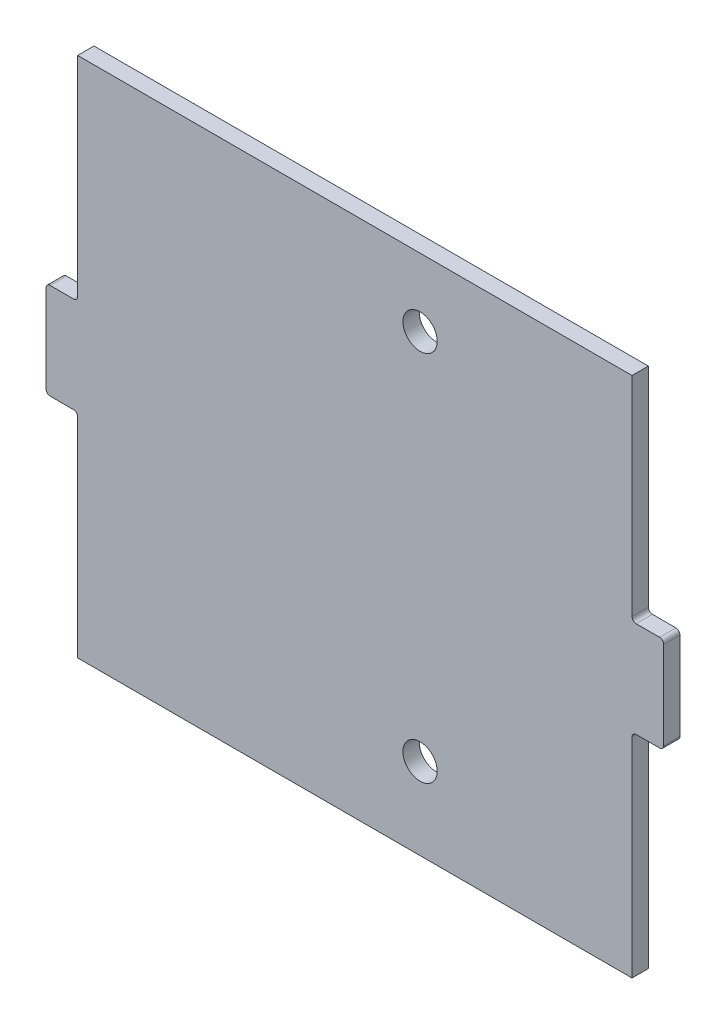
ISO-10303-21;
HEADER;
FILE_DESCRIPTION(('STEP AP214'),'2;1');
FILE_NAME('part.step','',(''),(''),'','','');
FILE_SCHEMA(('AUTOMOTIVE_DESIGN { 1 0 10303 214 1 1 1 1 }'));
ENDSEC;
DATA;
#1=APPLICATION_CONTEXT('core data for automotive mechanical design processes');
#2=APPLICATION_PROTOCOL_DEFINITION('international standard','automotive_design',2000,#1);
#3=PRODUCT_CONTEXT('',#1,'mechanical');
#4=PRODUCT('Part','Part','',(#3));
#5=PRODUCT_RELATED_PRODUCT_CATEGORY('part','',(#4));
#6=PRODUCT_DEFINITION_FORMATION('','',#4);
#7=PRODUCT_DEFINITION_CONTEXT('part definition',#1,'design');
#8=PRODUCT_DEFINITION('design','',#6,#7);
#9=PRODUCT_DEFINITION_SHAPE('','',#8);
#10=(LENGTH_UNIT() NAMED_UNIT(*) SI_UNIT(.MILLI.,.METRE.));
#11=(NAMED_UNIT(*) PLANE_ANGLE_UNIT() SI_UNIT($,.RADIAN.));
#12=(NAMED_UNIT(*) SI_UNIT($,.STERADIAN.) SOLID_ANGLE_UNIT());
#13=UNCERTAINTY_MEASURE_WITH_UNIT(LENGTH_MEASURE(1.E-05),#10,'distance_accuracy_value','');
#14=(GEOMETRIC_REPRESENTATION_CONTEXT(3) GLOBAL_UNCERTAINTY_ASSIGNED_CONTEXT((#13)) GLOBAL_UNIT_ASSIGNED_CONTEXT((#10,
#11,#12)) REPRESENTATION_CONTEXT('',''));
#15=CARTESIAN_POINT('',(0.,0.,0.));
#16=DIRECTION('',(0.,0.,1.));
#17=DIRECTION('',(1.,0.,0.));
#18=AXIS2_PLACEMENT_3D('',#15,#16,#17);
#19=CARTESIAN_POINT('',(215.9,-38.1,6.35));
#20=DIRECTION('',(-1.,0.,0.));
#21=DIRECTION('',(0.,-1.,0.));
#22=AXIS2_PLACEMENT_3D('',#19,#20,#21);
#23=PLANE('',#22);
#24=DIRECTION('',(0.,1.,0.));
#25=VECTOR('',#24,1.);
#26=CARTESIAN_POINT('',(215.9,-38.1,-6.35));
#27=LINE('',#26,#25);
#28=CARTESIAN_POINT('',(215.9,-203.2,-6.35));
#29=VERTEX_POINT('',#28);
#30=CARTESIAN_POINT('',(215.9,-40.513,-6.35));
#31=VERTEX_POINT('',#30);
#32=EDGE_CURVE('E204',#29,#31,#27,.T.);
#33=ORIENTED_EDGE('',*,*,#32,.T.);
#34=DIRECTION('',(0.,0.,-1.));
#35=VECTOR('',#34,1.);
#36=CARTESIAN_POINT('',(215.9,-40.513,6.35));
#37=LINE('',#36,#35);
#38=CARTESIAN_POINT('',(215.9,-40.513,6.35));
#39=VERTEX_POINT('',#38);
#40=EDGE_CURVE('E361',#31,#39,#37,.F.);
#41=ORIENTED_EDGE('',*,*,#40,.T.);
#42=DIRECTION('',(0.,1.,0.));
#43=VECTOR('',#42,1.);
#44=CARTESIAN_POINT('',(215.9,-38.1,6.35));
#45=LINE('',#44,#43);
#46=CARTESIAN_POINT('',(215.9,-203.2,6.35));
#47=VERTEX_POINT('',#46);
#48=EDGE_CURVE('E207',#47,#39,#45,.T.);
#49=ORIENTED_EDGE('',*,*,#48,.F.);
#50=DIRECTION('',(0.,0.,-1.));
#51=VECTOR('',#50,1.);
#52=CARTESIAN_POINT('',(215.9,-203.2,6.35));
#53=LINE('',#52,#51);
#54=EDGE_CURVE('E192',#47,#29,#53,.T.);
#55=ORIENTED_EDGE('',*,*,#54,.T.);
#56=EDGE_LOOP('',(#33,#41,#49,#55));
#57=FACE_BOUND('',#56,.T.);
#58=ADVANCED_FACE('F46',(#57),#23,.F.);
#59=CARTESIAN_POINT('',(215.9,-37.338,6.35));
#60=DIRECTION('',(0.,1.,0.));
#61=DIRECTION('',(-1.,0.,0.));
#62=AXIS2_PLACEMENT_3D('',#59,#60,#61);
#63=PLANE('',#62);
#64=DIRECTION('',(1.,0.,0.));
#65=VECTOR('',#64,1.);
#66=CARTESIAN_POINT('',(215.9,-37.338,-6.35));
#67=LINE('',#66,#65);
#68=CARTESIAN_POINT('',(219.075,-37.338,-6.35));
#69=VERTEX_POINT('',#68);
#70=CARTESIAN_POINT('',(237.363,-37.338,-6.35));
#71=VERTEX_POINT('',#70);
#72=EDGE_CURVE('E209',#69,#71,#67,.T.);
#73=ORIENTED_EDGE('',*,*,#72,.T.);
#74=DIRECTION('',(0.,0.,-1.));
#75=VECTOR('',#74,1.);
#76=CARTESIAN_POINT('',(237.363,-37.338,6.35));
#77=LINE('',#76,#75);
#78=CARTESIAN_POINT('',(237.363,-37.338,6.35));
#79=VERTEX_POINT('',#78);
#80=EDGE_CURVE('E358',#71,#79,#77,.F.);
#81=ORIENTED_EDGE('',*,*,#80,.T.);
#82=DIRECTION('',(1.,0.,0.));
#83=VECTOR('',#82,1.);
#84=CARTESIAN_POINT('',(215.9,-37.338,6.35));
#85=LINE('',#84,#83);
#86=CARTESIAN_POINT('',(219.075,-37.338,6.35));
#87=VERTEX_POINT('',#86);
#88=EDGE_CURVE('E241',#87,#79,#85,.T.);
#89=ORIENTED_EDGE('',*,*,#88,.F.);
#90=DIRECTION('',(0.,0.,-1.));
#91=VECTOR('',#90,1.);
#92=CARTESIAN_POINT('',(219.075,-37.338,-6.35));
#93=LINE('',#92,#91);
#94=EDGE_CURVE('E354',#87,#69,#93,.T.);
#95=ORIENTED_EDGE('',*,*,#94,.T.);
#96=EDGE_LOOP('',(#73,#81,#89,#95));
#97=FACE_BOUND('',#96,.T.);
#98=ADVANCED_FACE('F462',(#97),#63,.F.);
#99=CARTESIAN_POINT('',(240.538,38.1,6.35));
#100=DIRECTION('',(-1.,0.,0.));
#101=DIRECTION('',(0.,0.,1.));
#102=AXIS2_PLACEMENT_3D('',#99,#100,#101);
#103=PLANE('',#102);
#104=DIRECTION('',(0.,1.,0.));
#105=VECTOR('',#104,1.);
#106=CARTESIAN_POINT('',(240.538,38.1,-6.35));
#107=LINE('',#106,#105);
#108=CARTESIAN_POINT('',(240.538,-34.163,-6.35));
#109=VERTEX_POINT('',#108);
#110=CARTESIAN_POINT('',(240.538,34.163,-6.35));
#111=VERTEX_POINT('',#110);
#112=EDGE_CURVE('E243',#109,#111,#107,.T.);
#113=ORIENTED_EDGE('',*,*,#112,.T.);
#114=DIRECTION('',(0.,0.,-1.));
#115=VECTOR('',#114,1.);
#116=CARTESIAN_POINT('',(240.538,34.163,6.35));
#117=LINE('',#116,#115);
#118=CARTESIAN_POINT('',(240.538,34.163,6.35));
#119=VERTEX_POINT('',#118);
#120=EDGE_CURVE('E351',#111,#119,#117,.F.);
#121=ORIENTED_EDGE('',*,*,#120,.T.);
#122=DIRECTION('',(0.,1.,0.));
#123=VECTOR('',#122,1.);
#124=CARTESIAN_POINT('',(240.538,38.1,6.35));
#125=LINE('',#124,#123);
#126=CARTESIAN_POINT('',(240.538,-34.163,6.35));
#127=VERTEX_POINT('',#126);
#128=EDGE_CURVE('E254',#127,#119,#125,.T.);
#129=ORIENTED_EDGE('',*,*,#128,.F.);
#130=DIRECTION('',(0.,0.,-1.));
#131=VECTOR('',#130,1.);
#132=CARTESIAN_POINT('',(240.538,-34.163,6.35));
#133=LINE('',#132,#131);
#134=EDGE_CURVE('E347',#127,#109,#133,.T.);
#135=ORIENTED_EDGE('',*,*,#134,.T.);
#136=EDGE_LOOP('',(#113,#121,#129,#135));
#137=FACE_BOUND('',#136,.T.);
#138=ADVANCED_FACE('F471',(#137),#103,.F.);
#139=CARTESIAN_POINT('',(215.9,37.338,6.35));
#140=DIRECTION('',(0.,-1.,0.));
#141=DIRECTION('',(0.,0.,-1.));
#142=AXIS2_PLACEMENT_3D('',#139,#140,#141);
#143=PLANE('',#142);
#144=DIRECTION('',(-1.,0.,0.));
#145=VECTOR('',#144,1.);
#146=CARTESIAN_POINT('',(215.9,37.338,-6.35));
#147=LINE('',#146,#145);
#148=CARTESIAN_POINT('',(237.363,37.338,-6.35));
#149=VERTEX_POINT('',#148);
#150=CARTESIAN_POINT('',(219.075,37.338,-6.35));
#151=VERTEX_POINT('',#150);
#152=EDGE_CURVE('E247',#149,#151,#147,.T.);
#153=ORIENTED_EDGE('',*,*,#152,.T.);
#154=DIRECTION('',(0.,0.,-1.));
#155=VECTOR('',#154,1.);
#156=CARTESIAN_POINT('',(219.075,37.338,6.35));
#157=LINE('',#156,#155);
#158=CARTESIAN_POINT('',(219.075,37.338,6.35));
#159=VERTEX_POINT('',#158);
#160=EDGE_CURVE('E344',#151,#159,#157,.F.);
#161=ORIENTED_EDGE('',*,*,#160,.T.);
#162=DIRECTION('',(-1.,0.,0.));
#163=VECTOR('',#162,1.);
#164=CARTESIAN_POINT('',(215.9,37.338,6.35));
#165=LINE('',#164,#163);
#166=CARTESIAN_POINT('',(237.363,37.338,6.35));
#167=VERTEX_POINT('',#166);
#168=EDGE_CURVE('E238',#167,#159,#165,.T.);
#169=ORIENTED_EDGE('',*,*,#168,.F.);
#170=DIRECTION('',(0.,0.,-1.));
#171=VECTOR('',#170,1.);
#172=CARTESIAN_POINT('',(237.363,37.338,6.35));
#173=LINE('',#172,#171);
#174=EDGE_CURVE('E340',#167,#149,#173,.T.);
#175=ORIENTED_EDGE('',*,*,#174,.T.);
#176=EDGE_LOOP('',(#153,#161,#169,#175));
#177=FACE_BOUND('',#176,.T.);
#178=ADVANCED_FACE('F480',(#177),#143,.F.);
#179=CARTESIAN_POINT('',(215.9,203.2,6.35));
#180=DIRECTION('',(-1.,0.,0.));
#181=DIRECTION('',(0.,-1.,0.));
#182=AXIS2_PLACEMENT_3D('',#179,#180,#181);
#183=PLANE('',#182);
#184=DIRECTION('',(0.,1.,0.));
#185=VECTOR('',#184,1.);
#186=CARTESIAN_POINT('',(215.9,203.2,6.35));
#187=LINE('',#186,#185);
#188=CARTESIAN_POINT('',(215.9,40.513,6.35));
#189=VERTEX_POINT('',#188);
#190=CARTESIAN_POINT('',(215.9,203.2,6.35));
#191=VERTEX_POINT('',#190);
#192=EDGE_CURVE('E235',#189,#191,#187,.T.);
#193=ORIENTED_EDGE('',*,*,#192,.F.);
#194=DIRECTION('',(0.,0.,-1.));
#195=VECTOR('',#194,1.);
#196=CARTESIAN_POINT('',(215.9,40.513,-6.35));
#197=LINE('',#196,#195);
#198=CARTESIAN_POINT('',(215.9,40.513,-6.35));
#199=VERTEX_POINT('',#198);
#200=EDGE_CURVE('E336',#189,#199,#197,.T.);
#201=ORIENTED_EDGE('',*,*,#200,.T.);
#202=DIRECTION('',(0.,1.,0.));
#203=VECTOR('',#202,1.);
#204=CARTESIAN_POINT('',(215.9,203.2,-6.35));
#205=LINE('',#204,#203);
#206=CARTESIAN_POINT('',(215.9,203.2,-6.35));
#207=VERTEX_POINT('',#206);
#208=EDGE_CURVE('E218',#199,#207,#205,.T.);
#209=ORIENTED_EDGE('',*,*,#208,.T.);
#210=DIRECTION('',(0.,0.,-1.));
#211=VECTOR('',#210,1.);
#212=CARTESIAN_POINT('',(215.9,203.2,6.35));
#213=LINE('',#212,#211);
#214=EDGE_CURVE('E403',#191,#207,#213,.T.);
#215=ORIENTED_EDGE('',*,*,#214,.F.);
#216=EDGE_LOOP('',(#193,#201,#209,#215));
#217=FACE_BOUND('',#216,.T.);
#218=ADVANCED_FACE('F417',(#217),#183,.F.);
#219=CARTESIAN_POINT('',(-215.9,203.2,6.35));
#220=DIRECTION('',(0.,-1.,0.));
#221=DIRECTION('',(0.,0.,-1.));
#222=AXIS2_PLACEMENT_3D('',#219,#220,#221);
#223=PLANE('',#222);
#224=DIRECTION('',(-1.,0.,0.));
#225=VECTOR('',#224,1.);
#226=CARTESIAN_POINT('',(-215.9,203.2,-6.35));
#227=LINE('',#226,#225);
#228=CARTESIAN_POINT('',(-215.9,203.2,-6.35));
#229=VERTEX_POINT('',#228);
#230=EDGE_CURVE('E404',#207,#229,#227,.T.);
#231=ORIENTED_EDGE('',*,*,#230,.T.);
#232=DIRECTION('',(0.,0.,-1.));
#233=VECTOR('',#232,1.);
#234=CARTESIAN_POINT('',(-215.9,203.2,6.35));
#235=LINE('',#234,#233);
#236=CARTESIAN_POINT('',(-215.9,203.2,6.35));
#237=VERTEX_POINT('',#236);
#238=EDGE_CURVE('E268',#237,#229,#235,.T.);
#239=ORIENTED_EDGE('',*,*,#238,.F.);
#240=DIRECTION('',(-1.,0.,0.));
#241=VECTOR('',#240,1.);
#242=CARTESIAN_POINT('',(-215.9,203.2,6.35));
#243=LINE('',#242,#241);
#244=EDGE_CURVE('E232',#191,#237,#243,.T.);
#245=ORIENTED_EDGE('',*,*,#244,.F.);
#246=ORIENTED_EDGE('',*,*,#214,.T.);
#247=EDGE_LOOP('',(#231,#239,#245,#246));
#248=FACE_BOUND('',#247,.T.);
#249=ADVANCED_FACE('F420',(#248),#223,.F.);
#250=CARTESIAN_POINT('',(-215.9,203.2,6.35));
#251=DIRECTION('',(1.,0.,0.));
#252=DIRECTION('',(0.,0.,-1.));
#253=AXIS2_PLACEMENT_3D('',#250,#251,#252);
#254=PLANE('',#253);
#255=DIRECTION('',(0.,-1.,0.));
#256=VECTOR('',#255,1.);
#257=CARTESIAN_POINT('',(-215.9,203.2,-6.35));
#258=LINE('',#257,#256);
#259=CARTESIAN_POINT('',(-215.9,40.513,-6.35));
#260=VERTEX_POINT('',#259);
#261=EDGE_CURVE('E400',#229,#260,#258,.T.);
#262=ORIENTED_EDGE('',*,*,#261,.T.);
#263=DIRECTION('',(0.,0.,-1.));
#264=VECTOR('',#263,1.);
#265=CARTESIAN_POINT('',(-215.9,40.513,6.35));
#266=LINE('',#265,#264);
#267=CARTESIAN_POINT('',(-215.9,40.513,6.35));
#268=VERTEX_POINT('',#267);
#269=EDGE_CURVE('E333',#260,#268,#266,.F.);
#270=ORIENTED_EDGE('',*,*,#269,.T.);
#271=DIRECTION('',(0.,-1.,0.));
#272=VECTOR('',#271,1.);
#273=CARTESIAN_POINT('',(-215.9,203.2,6.35));
#274=LINE('',#273,#272);
#275=EDGE_CURVE('E228',#237,#268,#274,.T.);
#276=ORIENTED_EDGE('',*,*,#275,.F.);
#277=ORIENTED_EDGE('',*,*,#238,.T.);
#278=EDGE_LOOP('',(#262,#270,#276,#277));
#279=FACE_BOUND('',#278,.T.);
#280=ADVANCED_FACE('F425',(#279),#254,.F.);
#281=CARTESIAN_POINT('',(-215.9,37.338,6.35));
#282=DIRECTION('',(0.,-1.,0.));
#283=DIRECTION('',(1.,0.,0.));
#284=AXIS2_PLACEMENT_3D('',#281,#282,#283);
#285=PLANE('',#284);
#286=DIRECTION('',(-1.,0.,0.));
#287=VECTOR('',#286,1.);
#288=CARTESIAN_POINT('',(-215.9,37.338,-6.35));
#289=LINE('',#288,#287);
#290=CARTESIAN_POINT('',(-219.075,37.338,-6.35));
#291=VERTEX_POINT('',#290);
#292=CARTESIAN_POINT('',(-237.363,37.338,-6.35));
#293=VERTEX_POINT('',#292);
#294=EDGE_CURVE('E264',#291,#293,#289,.T.);
#295=ORIENTED_EDGE('',*,*,#294,.T.);
#296=DIRECTION('',(0.,0.,-1.));
#297=VECTOR('',#296,1.);
#298=CARTESIAN_POINT('',(-237.363,37.338,6.35));
#299=LINE('',#298,#297);
#300=CARTESIAN_POINT('',(-237.363,37.338,6.35));
#301=VERTEX_POINT('',#300);
#302=EDGE_CURVE('E64',#293,#301,#299,.F.);
#303=ORIENTED_EDGE('',*,*,#302,.T.);
#304=DIRECTION('',(-1.,0.,0.));
#305=VECTOR('',#304,1.);
#306=CARTESIAN_POINT('',(-215.9,37.338,6.35));
#307=LINE('',#306,#305);
#308=CARTESIAN_POINT('',(-219.075,37.338,6.35));
#309=VERTEX_POINT('',#308);
#310=EDGE_CURVE('E231',#309,#301,#307,.T.);
#311=ORIENTED_EDGE('',*,*,#310,.F.);
#312=DIRECTION('',(0.,0.,-1.));
#313=VECTOR('',#312,1.);
#314=CARTESIAN_POINT('',(-219.075,37.338,-6.35));
#315=LINE('',#314,#313);
#316=EDGE_CURVE('E327',#309,#291,#315,.T.);
#317=ORIENTED_EDGE('',*,*,#316,.T.);
#318=EDGE_LOOP('',(#295,#303,#311,#317));
#319=FACE_BOUND('',#318,.T.);
#320=ADVANCED_FACE('F430',(#319),#285,.F.);
#321=CARTESIAN_POINT('',(-240.538,38.1,6.35));
#322=DIRECTION('',(1.,0.,0.));
#323=DIRECTION('',(0.,0.,-1.));
#324=AXIS2_PLACEMENT_3D('',#321,#322,#323);
#325=PLANE('',#324);
#326=DIRECTION('',(0.,-1.,0.));
#327=VECTOR('',#326,1.);
#328=CARTESIAN_POINT('',(-240.538,38.1,-6.35));
#329=LINE('',#328,#327);
#330=CARTESIAN_POINT('',(-240.538,34.163,-6.35));
#331=VERTEX_POINT('',#330);
#332=CARTESIAN_POINT('',(-240.538,-34.163,-6.35));
#333=VERTEX_POINT('',#332);
#334=EDGE_CURVE('E267',#331,#333,#329,.T.);
#335=ORIENTED_EDGE('',*,*,#334,.T.);
#336=DIRECTION('',(0.,0.,-1.));
#337=VECTOR('',#336,1.);
#338=CARTESIAN_POINT('',(-240.538,-34.163,6.35));
#339=LINE('',#338,#337);
#340=CARTESIAN_POINT('',(-240.538,-34.163,6.35));
#341=VERTEX_POINT('',#340);
#342=EDGE_CURVE('E312',#333,#341,#339,.F.);
#343=ORIENTED_EDGE('',*,*,#342,.T.);
#344=DIRECTION('',(0.,-1.,0.));
#345=VECTOR('',#344,1.);
#346=CARTESIAN_POINT('',(-240.538,38.1,6.35));
#347=LINE('',#346,#345);
#348=CARTESIAN_POINT('',(-240.538,34.163,6.35));
#349=VERTEX_POINT('',#348);
#350=EDGE_CURVE('E271',#349,#341,#347,.T.);
#351=ORIENTED_EDGE('',*,*,#350,.F.);
#352=DIRECTION('',(0.,0.,-1.));
#353=VECTOR('',#352,1.);
#354=CARTESIAN_POINT('',(-240.538,34.163,6.35));
#355=LINE('',#354,#353);
#356=EDGE_CURVE('E308',#349,#331,#355,.T.);
#357=ORIENTED_EDGE('',*,*,#356,.T.);
#358=EDGE_LOOP('',(#335,#343,#351,#357));
#359=FACE_BOUND('',#358,.T.);
#360=ADVANCED_FACE('F438',(#359),#325,.F.);
#361=CARTESIAN_POINT('',(-215.9,-37.338,6.35));
#362=DIRECTION('',(0.,1.,0.));
#363=DIRECTION('',(-1.,0.,0.));
#364=AXIS2_PLACEMENT_3D('',#361,#362,#363);
#365=PLANE('',#364);
#366=DIRECTION('',(1.,0.,0.));
#367=VECTOR('',#366,1.);
#368=CARTESIAN_POINT('',(-215.9,-37.338,-6.35));
#369=LINE('',#368,#367);
#370=CARTESIAN_POINT('',(-237.363,-37.338,-6.35));
#371=VERTEX_POINT('',#370);
#372=CARTESIAN_POINT('',(-219.075,-37.338,-6.35));
#373=VERTEX_POINT('',#372);
#374=EDGE_CURVE('E278',#371,#373,#369,.T.);
#375=ORIENTED_EDGE('',*,*,#374,.T.);
#376=DIRECTION('',(0.,0.,-1.));
#377=VECTOR('',#376,1.);
#378=CARTESIAN_POINT('',(-219.075,-37.338,6.35));
#379=LINE('',#378,#377);
#380=CARTESIAN_POINT('',(-219.075,-37.338,6.35));
#381=VERTEX_POINT('',#380);
#382=EDGE_CURVE('E293',#373,#381,#379,.F.);
#383=ORIENTED_EDGE('',*,*,#382,.T.);
#384=DIRECTION('',(1.,0.,0.));
#385=VECTOR('',#384,1.);
#386=CARTESIAN_POINT('',(-215.9,-37.338,6.35));
#387=LINE('',#386,#385);
#388=CARTESIAN_POINT('',(-237.363,-37.338,6.35));
#389=VERTEX_POINT('',#388);
#390=EDGE_CURVE('E227',#389,#381,#387,.T.);
#391=ORIENTED_EDGE('',*,*,#390,.F.);
#392=DIRECTION('',(0.,0.,-1.));
#393=VECTOR('',#392,1.);
#394=CARTESIAN_POINT('',(-237.363,-37.338,6.35));
#395=LINE('',#394,#393);
#396=EDGE_CURVE('E289',#389,#371,#395,.T.);
#397=ORIENTED_EDGE('',*,*,#396,.T.);
#398=EDGE_LOOP('',(#375,#383,#391,#397));
#399=FACE_BOUND('',#398,.T.);
#400=ADVANCED_FACE('F447',(#399),#365,.F.);
#401=CARTESIAN_POINT('',(-215.9,-38.1,6.35));
#402=DIRECTION('',(1.,0.,0.));
#403=DIRECTION('',(0.,1.,0.));
#404=AXIS2_PLACEMENT_3D('',#401,#402,#403);
#405=PLANE('',#404);
#406=DIRECTION('',(0.,-1.,0.));
#407=VECTOR('',#406,1.);
#408=CARTESIAN_POINT('',(-215.9,-38.1,6.35));
#409=LINE('',#408,#407);
#410=CARTESIAN_POINT('',(-215.9,-40.513,6.35));
#411=VERTEX_POINT('',#410);
#412=CARTESIAN_POINT('',(-215.9,-203.2,6.35));
#413=VERTEX_POINT('',#412);
#414=EDGE_CURVE('E224',#411,#413,#409,.T.);
#415=ORIENTED_EDGE('',*,*,#414,.F.);
#416=DIRECTION('',(0.,0.,-1.));
#417=VECTOR('',#416,1.);
#418=CARTESIAN_POINT('',(-215.9,-40.513,-6.35));
#419=LINE('',#418,#417);
#420=CARTESIAN_POINT('',(-215.9,-40.513,-6.35));
#421=VERTEX_POINT('',#420);
#422=EDGE_CURVE('E285',#411,#421,#419,.T.);
#423=ORIENTED_EDGE('',*,*,#422,.T.);
#424=DIRECTION('',(0.,-1.,0.));
#425=VECTOR('',#424,1.);
#426=CARTESIAN_POINT('',(-215.9,-38.1,-6.35));
#427=LINE('',#426,#425);
#428=CARTESIAN_POINT('',(-215.9,-203.2,-6.35));
#429=VERTEX_POINT('',#428);
#430=EDGE_CURVE('E200',#421,#429,#427,.T.);
#431=ORIENTED_EDGE('',*,*,#430,.T.);
#432=DIRECTION('',(0.,0.,-1.));
#433=VECTOR('',#432,1.);
#434=CARTESIAN_POINT('',(-215.9,-203.2,6.35));
#435=LINE('',#434,#433);
#436=EDGE_CURVE('E195',#413,#429,#435,.T.);
#437=ORIENTED_EDGE('',*,*,#436,.F.);
#438=EDGE_LOOP('',(#415,#423,#431,#437));
#439=FACE_BOUND('',#438,.T.);
#440=ADVANCED_FACE('F455',(#439),#405,.F.);
#441=CARTESIAN_POINT('',(-215.9,-203.2,6.35));
#442=DIRECTION('',(0.,1.,0.));
#443=DIRECTION('',(0.,0.,1.));
#444=AXIS2_PLACEMENT_3D('',#441,#442,#443);
#445=PLANE('',#444);
#446=DIRECTION('',(1.,0.,0.));
#447=VECTOR('',#446,1.);
#448=CARTESIAN_POINT('',(-215.9,-203.2,-6.35));
#449=LINE('',#448,#447);
#450=EDGE_CURVE('E188',#429,#29,#449,.T.);
#451=ORIENTED_EDGE('',*,*,#450,.T.);
#452=ORIENTED_EDGE('',*,*,#54,.F.);
#453=DIRECTION('',(1.,0.,0.));
#454=VECTOR('',#453,1.);
#455=CARTESIAN_POINT('',(-215.9,-203.2,6.35));
#456=LINE('',#455,#454);
#457=EDGE_CURVE('E220',#413,#47,#456,.T.);
#458=ORIENTED_EDGE('',*,*,#457,.F.);
#459=ORIENTED_EDGE('',*,*,#436,.T.);
#460=EDGE_LOOP('',(#451,#452,#458,#459));
#461=FACE_BOUND('',#460,.T.);
#462=ADVANCED_FACE('F190',(#461),#445,.F.);
#463=CARTESIAN_POINT('',(0.,0.,6.35));
#464=DIRECTION('',(0.,0.,1.));
#465=DIRECTION('',(1.,0.,0.));
#466=AXIS2_PLACEMENT_3D('',#463,#464,#465);
#467=PLANE('',#466);
#468=CARTESIAN_POINT('',(50.8000000000004,150.299999999983,6.34999999999999));
#469=DIRECTION('',(0.,0.,1.));
#470=DIRECTION('',(1.,0.,0.));
#471=AXIS2_PLACEMENT_3D('',#468,#469,#470);
#472=CIRCLE('',#471,13.3350000000001);
#473=CARTESIAN_POINT('',(64.1350000000005,150.299999999983,6.34999999999999));
#474=VERTEX_POINT('',#473);
#475=EDGE_CURVE('E386',#474,#474,#472,.F.);
#476=ORIENTED_EDGE('',*,*,#475,.T.);
#477=EDGE_LOOP('',(#476));
#478=FACE_BOUND('',#477,.T.);
#479=CARTESIAN_POINT('',(50.8000000000004,-139.700000000005,6.34999999999999));
#480=DIRECTION('',(0.,0.,1.));
#481=DIRECTION('',(1.,0.,0.));
#482=AXIS2_PLACEMENT_3D('',#479,#480,#481);
#483=CIRCLE('',#482,13.3350000000001);
#484=CARTESIAN_POINT('',(64.1350000000005,-139.700000000005,6.34999999999999));
#485=VERTEX_POINT('',#484);
#486=EDGE_CURVE('E242',#485,#485,#483,.F.);
#487=ORIENTED_EDGE('',*,*,#486,.T.);
#488=EDGE_LOOP('',(#487));
#489=FACE_BOUND('',#488,.T.);
#490=ORIENTED_EDGE('',*,*,#350,.T.);
#491=CARTESIAN_POINT('',(-237.363,-34.163,6.35));
#492=DIRECTION('',(0.,0.,1.));
#493=DIRECTION('',(1.,0.,0.));
#494=AXIS2_PLACEMENT_3D('',#491,#492,#493);
#495=CIRCLE('',#494,3.175);
#496=EDGE_CURVE('E324',#341,#389,#495,.T.);
#497=ORIENTED_EDGE('',*,*,#496,.T.);
#498=ORIENTED_EDGE('',*,*,#390,.T.);
#499=CARTESIAN_POINT('',(-219.075,-40.513,6.35));
#500=DIRECTION('',(0.,0.,1.));
#501=DIRECTION('',(1.,0.,0.));
#502=AXIS2_PLACEMENT_3D('',#499,#500,#501);
#503=CIRCLE('',#502,3.175);
#504=EDGE_CURVE('E367',#381,#411,#503,.F.);
#505=ORIENTED_EDGE('',*,*,#504,.T.);
#506=ORIENTED_EDGE('',*,*,#414,.T.);
#507=ORIENTED_EDGE('',*,*,#457,.T.);
#508=ORIENTED_EDGE('',*,*,#48,.T.);
#509=CARTESIAN_POINT('',(219.075,-40.513,6.35));
#510=DIRECTION('',(0.,0.,1.));
#511=DIRECTION('',(1.,0.,0.));
#512=AXIS2_PLACEMENT_3D('',#509,#510,#511);
#513=CIRCLE('',#512,3.175);
#514=EDGE_CURVE('E12',#39,#87,#513,.F.);
#515=ORIENTED_EDGE('',*,*,#514,.T.);
#516=ORIENTED_EDGE('',*,*,#88,.T.);
#517=CARTESIAN_POINT('',(237.363,-34.163,6.35));
#518=DIRECTION('',(0.,0.,1.));
#519=DIRECTION('',(1.,0.,0.));
#520=AXIS2_PLACEMENT_3D('',#517,#518,#519);
#521=CIRCLE('',#520,3.175);
#522=EDGE_CURVE('E315',#79,#127,#521,.T.);
#523=ORIENTED_EDGE('',*,*,#522,.T.);
#524=ORIENTED_EDGE('',*,*,#128,.T.);
#525=CARTESIAN_POINT('',(237.363,34.163,6.35));
#526=DIRECTION('',(0.,0.,1.));
#527=DIRECTION('',(1.,0.,0.));
#528=AXIS2_PLACEMENT_3D('',#525,#526,#527);
#529=CIRCLE('',#528,3.175);
#530=EDGE_CURVE('E318',#119,#167,#529,.T.);
#531=ORIENTED_EDGE('',*,*,#530,.T.);
#532=ORIENTED_EDGE('',*,*,#168,.T.);
#533=CARTESIAN_POINT('',(219.075,40.513,6.35));
#534=DIRECTION('',(0.,0.,1.));
#535=DIRECTION('',(1.,0.,0.));
#536=AXIS2_PLACEMENT_3D('',#533,#534,#535);
#537=CIRCLE('',#536,3.175);
#538=EDGE_CURVE('E378',#159,#189,#537,.F.);
#539=ORIENTED_EDGE('',*,*,#538,.T.);
#540=ORIENTED_EDGE('',*,*,#192,.T.);
#541=ORIENTED_EDGE('',*,*,#244,.T.);
#542=ORIENTED_EDGE('',*,*,#275,.T.);
#543=CARTESIAN_POINT('',(-219.075,40.513,6.35));
#544=DIRECTION('',(0.,0.,1.));
#545=DIRECTION('',(1.,0.,0.));
#546=AXIS2_PLACEMENT_3D('',#543,#544,#545);
#547=CIRCLE('',#546,3.175);
#548=EDGE_CURVE('E71',#268,#309,#547,.F.);
#549=ORIENTED_EDGE('',*,*,#548,.T.);
#550=ORIENTED_EDGE('',*,*,#310,.T.);
#551=CARTESIAN_POINT('',(-237.363,34.163,6.35));
#552=DIRECTION('',(0.,0.,1.));
#553=DIRECTION('',(1.,0.,0.));
#554=AXIS2_PLACEMENT_3D('',#551,#552,#553);
#555=CIRCLE('',#554,3.175);
#556=EDGE_CURVE('E321',#301,#349,#555,.T.);
#557=ORIENTED_EDGE('',*,*,#556,.T.);
#558=EDGE_LOOP('',(#490,#497,#498,#505,#506,#507,#508,#515,#516,#523,#524,#531,#532,#539,#540,
#541,#542,#549,#550,#557));
#559=FACE_BOUND('',#558,.T.);
#560=ADVANCED_FACE('F441',(#478,#489,#559),#467,.T.);
#561=CARTESIAN_POINT('',(0.,0.,-6.35));
#562=DIRECTION('',(0.,0.,1.));
#563=DIRECTION('',(1.,0.,0.));
#564=AXIS2_PLACEMENT_3D('',#561,#562,#563);
#565=PLANE('',#564);
#566=CARTESIAN_POINT('',(50.8000000000004,150.299999999983,-6.35000000000002));
#567=DIRECTION('',(0.,0.,1.));
#568=DIRECTION('',(1.,0.,0.));
#569=AXIS2_PLACEMENT_3D('',#566,#567,#568);
#570=CIRCLE('',#569,13.3350000000001);
#571=CARTESIAN_POINT('',(64.1350000000005,150.299999999983,-6.35000000000002));
#572=VERTEX_POINT('',#571);
#573=EDGE_CURVE('E50',#572,#572,#570,.F.);
#574=ORIENTED_EDGE('',*,*,#573,.F.);
#575=EDGE_LOOP('',(#574));
#576=FACE_BOUND('',#575,.T.);
#577=CARTESIAN_POINT('',(50.8000000000004,-139.700000000005,-6.34999999999999));
#578=DIRECTION('',(0.,0.,1.));
#579=DIRECTION('',(1.,0.,0.));
#580=AXIS2_PLACEMENT_3D('',#577,#578,#579);
#581=CIRCLE('',#580,13.3350000000001);
#582=CARTESIAN_POINT('',(64.1350000000005,-139.700000000005,-6.34999999999999));
#583=VERTEX_POINT('',#582);
#584=EDGE_CURVE('E223',#583,#583,#581,.F.);
#585=ORIENTED_EDGE('',*,*,#584,.F.);
#586=EDGE_LOOP('',(#585));
#587=FACE_BOUND('',#586,.T.);
#588=ORIENTED_EDGE('',*,*,#374,.F.);
#589=CARTESIAN_POINT('',(-237.363,-34.163,-6.35));
#590=DIRECTION('',(0.,0.,1.));
#591=DIRECTION('',(1.,0.,0.));
#592=AXIS2_PLACEMENT_3D('',#589,#590,#591);
#593=CIRCLE('',#592,3.175);
#594=EDGE_CURVE('E305',#371,#333,#593,.F.);
#595=ORIENTED_EDGE('',*,*,#594,.T.);
#596=ORIENTED_EDGE('',*,*,#334,.F.);
#597=CARTESIAN_POINT('',(-237.363,34.163,-6.35));
#598=DIRECTION('',(0.,0.,1.));
#599=DIRECTION('',(1.,0.,0.));
#600=AXIS2_PLACEMENT_3D('',#597,#598,#599);
#601=CIRCLE('',#600,3.175);
#602=EDGE_CURVE('E302',#331,#293,#601,.F.);
#603=ORIENTED_EDGE('',*,*,#602,.T.);
#604=ORIENTED_EDGE('',*,*,#294,.F.);
#605=CARTESIAN_POINT('',(-219.075,40.513,-6.35));
#606=DIRECTION('',(0.,0.,1.));
#607=DIRECTION('',(1.,0.,0.));
#608=AXIS2_PLACEMENT_3D('',#605,#606,#607);
#609=CIRCLE('',#608,3.175);
#610=EDGE_CURVE('E370',#291,#260,#609,.T.);
#611=ORIENTED_EDGE('',*,*,#610,.T.);
#612=ORIENTED_EDGE('',*,*,#261,.F.);
#613=ORIENTED_EDGE('',*,*,#230,.F.);
#614=ORIENTED_EDGE('',*,*,#208,.F.);
#615=CARTESIAN_POINT('',(219.075,40.513,-6.35));
#616=DIRECTION('',(0.,0.,1.));
#617=DIRECTION('',(1.,0.,0.));
#618=AXIS2_PLACEMENT_3D('',#615,#616,#617);
#619=CIRCLE('',#618,3.175);
#620=EDGE_CURVE('E375',#199,#151,#619,.T.);
#621=ORIENTED_EDGE('',*,*,#620,.T.);
#622=ORIENTED_EDGE('',*,*,#152,.F.);
#623=CARTESIAN_POINT('',(237.363,34.163,-6.35));
#624=DIRECTION('',(0.,0.,1.));
#625=DIRECTION('',(1.,0.,0.));
#626=AXIS2_PLACEMENT_3D('',#623,#624,#625);
#627=CIRCLE('',#626,3.175);
#628=EDGE_CURVE('E299',#149,#111,#627,.F.);
#629=ORIENTED_EDGE('',*,*,#628,.T.);
#630=ORIENTED_EDGE('',*,*,#112,.F.);
#631=CARTESIAN_POINT('',(237.363,-34.163,-6.35));
#632=DIRECTION('',(0.,0.,1.));
#633=DIRECTION('',(1.,0.,0.));
#634=AXIS2_PLACEMENT_3D('',#631,#632,#633);
#635=CIRCLE('',#634,3.175);
#636=EDGE_CURVE('E296',#109,#71,#635,.F.);
#637=ORIENTED_EDGE('',*,*,#636,.T.);
#638=ORIENTED_EDGE('',*,*,#72,.F.);
#639=CARTESIAN_POINT('',(219.075,-40.513,-6.35));
#640=DIRECTION('',(0.,0.,1.));
#641=DIRECTION('',(1.,0.,0.));
#642=AXIS2_PLACEMENT_3D('',#639,#640,#641);
#643=CIRCLE('',#642,3.175);
#644=EDGE_CURVE('E56',#69,#31,#643,.T.);
#645=ORIENTED_EDGE('',*,*,#644,.T.);
#646=ORIENTED_EDGE('',*,*,#32,.F.);
#647=ORIENTED_EDGE('',*,*,#450,.F.);
#648=ORIENTED_EDGE('',*,*,#430,.F.);
#649=CARTESIAN_POINT('',(-219.075,-40.513,-6.35));
#650=DIRECTION('',(0.,0.,1.));
#651=DIRECTION('',(1.,0.,0.));
#652=AXIS2_PLACEMENT_3D('',#649,#650,#651);
#653=CIRCLE('',#652,3.175);
#654=EDGE_CURVE('E364',#421,#373,#653,.T.);
#655=ORIENTED_EDGE('',*,*,#654,.T.);
#656=EDGE_LOOP('',(#588,#595,#596,#603,#604,#611,#612,#613,#614,#621,#622,#629,#630,#637,#638,
#645,#646,#647,#648,#655));
#657=FACE_BOUND('',#656,.T.);
#658=ADVANCED_FACE('F212',(#576,#587,#657),#565,.F.);
#659=CARTESIAN_POINT('',(50.8000000000004,-139.700000000005,173.4));
#660=DIRECTION('',(0.,0.,-1.));
#661=DIRECTION('',(-1.,0.,0.));
#662=AXIS2_PLACEMENT_3D('',#659,#660,#661);
#663=CYLINDRICAL_SURFACE('',#662,13.3350000000001);
#664=ORIENTED_EDGE('',*,*,#486,.F.);
#665=EDGE_LOOP('',(#664));
#666=FACE_BOUND('',#665,.T.);
#667=ORIENTED_EDGE('',*,*,#584,.T.);
#668=EDGE_LOOP('',(#667));
#669=FACE_BOUND('',#668,.T.);
#670=ADVANCED_FACE('F513',(#666,#669),#663,.F.);
#671=CARTESIAN_POINT('',(50.8000000000004,150.299999999983,248.4));
#672=DIRECTION('',(0.,0.,-1.));
#673=DIRECTION('',(-1.,0.,0.));
#674=AXIS2_PLACEMENT_3D('',#671,#672,#673);
#675=CYLINDRICAL_SURFACE('',#674,13.3350000000001);
#676=ORIENTED_EDGE('',*,*,#475,.F.);
#677=EDGE_LOOP('',(#676));
#678=FACE_BOUND('',#677,.T.);
#679=ORIENTED_EDGE('',*,*,#573,.T.);
#680=EDGE_LOOP('',(#679));
#681=FACE_BOUND('',#680,.T.);
#682=ADVANCED_FACE('F48',(#678,#681),#675,.F.);
#683=CARTESIAN_POINT('',(-219.075,-40.513,6.35));
#684=DIRECTION('',(0.,0.,1.));
#685=DIRECTION('',(1.,0.,0.));
#686=AXIS2_PLACEMENT_3D('',#683,#684,#685);
#687=CYLINDRICAL_SURFACE('',#686,3.175);
#688=ORIENTED_EDGE('',*,*,#504,.F.);
#689=ORIENTED_EDGE('',*,*,#382,.F.);
#690=ORIENTED_EDGE('',*,*,#654,.F.);
#691=ORIENTED_EDGE('',*,*,#422,.F.);
#692=EDGE_LOOP('',(#688,#689,#690,#691));
#693=FACE_BOUND('',#692,.T.);
#694=ADVANCED_FACE('F452',(#693),#687,.F.);
#695=CARTESIAN_POINT('',(-237.363,-34.163,6.35));
#696=DIRECTION('',(0.,0.,-1.));
#697=DIRECTION('',(-1.,0.,0.));
#698=AXIS2_PLACEMENT_3D('',#695,#696,#697);
#699=CYLINDRICAL_SURFACE('',#698,3.175);
#700=ORIENTED_EDGE('',*,*,#496,.F.);
#701=ORIENTED_EDGE('',*,*,#342,.F.);
#702=ORIENTED_EDGE('',*,*,#594,.F.);
#703=ORIENTED_EDGE('',*,*,#396,.F.);
#704=EDGE_LOOP('',(#700,#701,#702,#703));
#705=FACE_BOUND('',#704,.T.);
#706=ADVANCED_FACE('F445',(#705),#699,.T.);
#707=CARTESIAN_POINT('',(-237.363,34.163,6.35));
#708=DIRECTION('',(0.,0.,-1.));
#709=DIRECTION('',(-1.,0.,0.));
#710=AXIS2_PLACEMENT_3D('',#707,#708,#709);
#711=CYLINDRICAL_SURFACE('',#710,3.175);
#712=ORIENTED_EDGE('',*,*,#556,.F.);
#713=ORIENTED_EDGE('',*,*,#302,.F.);
#714=ORIENTED_EDGE('',*,*,#602,.F.);
#715=ORIENTED_EDGE('',*,*,#356,.F.);
#716=EDGE_LOOP('',(#712,#713,#714,#715));
#717=FACE_BOUND('',#716,.T.);
#718=ADVANCED_FACE('F435',(#717),#711,.T.);
#719=CARTESIAN_POINT('',(-219.075,40.513,6.35));
#720=DIRECTION('',(0.,0.,1.));
#721=DIRECTION('',(1.,0.,0.));
#722=AXIS2_PLACEMENT_3D('',#719,#720,#721);
#723=CYLINDRICAL_SURFACE('',#722,3.175);
#724=ORIENTED_EDGE('',*,*,#548,.F.);
#725=ORIENTED_EDGE('',*,*,#269,.F.);
#726=ORIENTED_EDGE('',*,*,#610,.F.);
#727=ORIENTED_EDGE('',*,*,#316,.F.);
#728=EDGE_LOOP('',(#724,#725,#726,#727));
#729=FACE_BOUND('',#728,.T.);
#730=ADVANCED_FACE('F428',(#729),#723,.F.);
#731=CARTESIAN_POINT('',(219.075,40.513,6.35));
#732=DIRECTION('',(0.,0.,1.));
#733=DIRECTION('',(1.,0.,0.));
#734=AXIS2_PLACEMENT_3D('',#731,#732,#733);
#735=CYLINDRICAL_SURFACE('',#734,3.175);
#736=ORIENTED_EDGE('',*,*,#538,.F.);
#737=ORIENTED_EDGE('',*,*,#160,.F.);
#738=ORIENTED_EDGE('',*,*,#620,.F.);
#739=ORIENTED_EDGE('',*,*,#200,.F.);
#740=EDGE_LOOP('',(#736,#737,#738,#739));
#741=FACE_BOUND('',#740,.T.);
#742=ADVANCED_FACE('F484',(#741),#735,.F.);
#743=CARTESIAN_POINT('',(237.363,34.163,6.35));
#744=DIRECTION('',(0.,0.,-1.));
#745=DIRECTION('',(-1.,0.,0.));
#746=AXIS2_PLACEMENT_3D('',#743,#744,#745);
#747=CYLINDRICAL_SURFACE('',#746,3.175);
#748=ORIENTED_EDGE('',*,*,#530,.F.);
#749=ORIENTED_EDGE('',*,*,#120,.F.);
#750=ORIENTED_EDGE('',*,*,#628,.F.);
#751=ORIENTED_EDGE('',*,*,#174,.F.);
#752=EDGE_LOOP('',(#748,#749,#750,#751));
#753=FACE_BOUND('',#752,.T.);
#754=ADVANCED_FACE('F477',(#753),#747,.T.);
#755=CARTESIAN_POINT('',(237.363,-34.163,6.35));
#756=DIRECTION('',(0.,0.,-1.));
#757=DIRECTION('',(-1.,0.,0.));
#758=AXIS2_PLACEMENT_3D('',#755,#756,#757);
#759=CYLINDRICAL_SURFACE('',#758,3.175);
#760=ORIENTED_EDGE('',*,*,#522,.F.);
#761=ORIENTED_EDGE('',*,*,#80,.F.);
#762=ORIENTED_EDGE('',*,*,#636,.F.);
#763=ORIENTED_EDGE('',*,*,#134,.F.);
#764=EDGE_LOOP('',(#760,#761,#762,#763));
#765=FACE_BOUND('',#764,.T.);
#766=ADVANCED_FACE('F468',(#765),#759,.T.);
#767=CARTESIAN_POINT('',(219.075,-40.513,6.35));
#768=DIRECTION('',(0.,0.,1.));
#769=DIRECTION('',(1.,0.,0.));
#770=AXIS2_PLACEMENT_3D('',#767,#768,#769);
#771=CYLINDRICAL_SURFACE('',#770,3.175);
#772=ORIENTED_EDGE('',*,*,#514,.F.);
#773=ORIENTED_EDGE('',*,*,#40,.F.);
#774=ORIENTED_EDGE('',*,*,#644,.F.);
#775=ORIENTED_EDGE('',*,*,#94,.F.);
#776=EDGE_LOOP('',(#772,#773,#774,#775));
#777=FACE_BOUND('',#776,.T.);
#778=ADVANCED_FACE('F460',(#777),#771,.F.);
#779=CLOSED_SHELL('',(#58,#98,#138,#178,#218,#249,#280,#320,#360,#400,#440,#462,#560,#658,#670,
#682,#694,#706,#718,#730,#742,#754,#766,#778));
#780=MANIFOLD_SOLID_BREP('B2',#779);
#781=ADVANCED_BREP_SHAPE_REPRESENTATION('',(#18,#780),#14);
#782=SHAPE_DEFINITION_REPRESENTATION(#9,#781);
ENDSEC;
END-ISO-10303-21;
